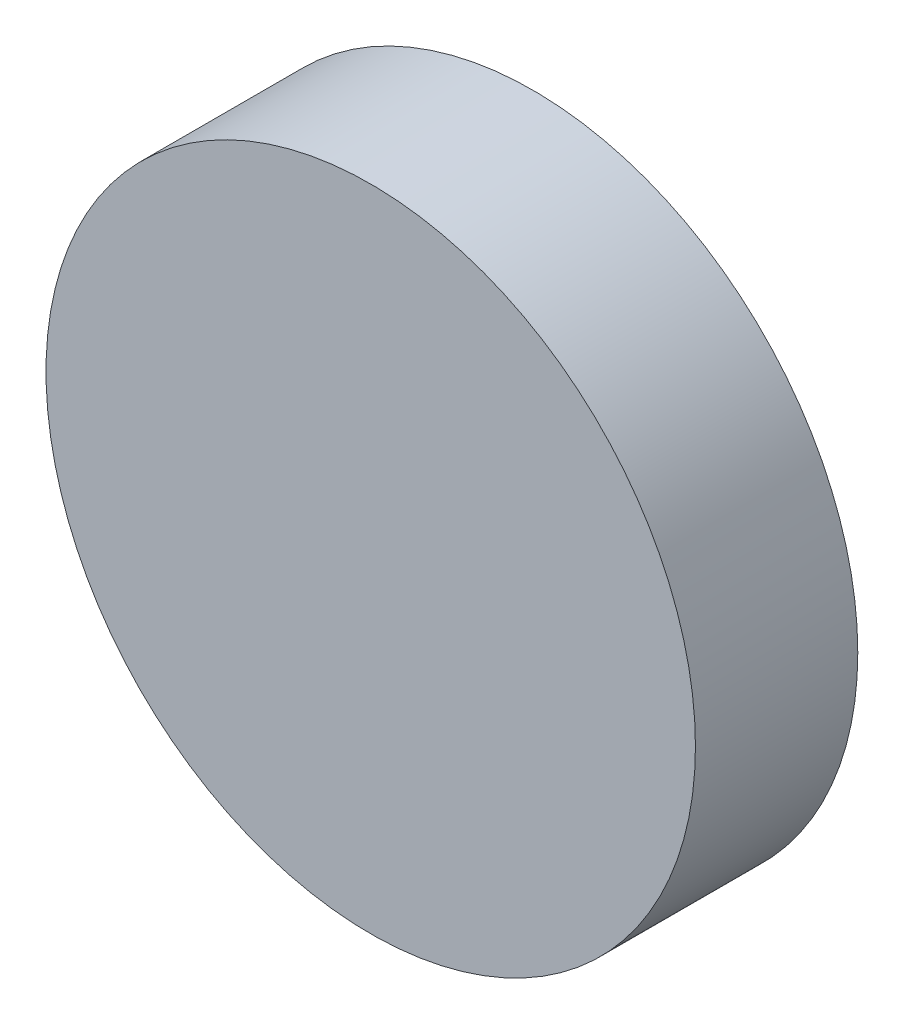
ISO-10303-21;
HEADER;
FILE_DESCRIPTION(('STEP AP214'),'2;1');
FILE_NAME('part.step','',(''),(''),'','','');
FILE_SCHEMA(('AUTOMOTIVE_DESIGN { 1 0 10303 214 1 1 1 1 }'));
ENDSEC;
DATA;
#1=APPLICATION_CONTEXT('core data for automotive mechanical design processes');
#2=APPLICATION_PROTOCOL_DEFINITION('international standard','automotive_design',2000,#1);
#3=PRODUCT_CONTEXT('',#1,'mechanical');
#4=PRODUCT('Part','Part','',(#3));
#5=PRODUCT_RELATED_PRODUCT_CATEGORY('part','',(#4));
#6=PRODUCT_DEFINITION_FORMATION('','',#4);
#7=PRODUCT_DEFINITION_CONTEXT('part definition',#1,'design');
#8=PRODUCT_DEFINITION('design','',#6,#7);
#9=PRODUCT_DEFINITION_SHAPE('','',#8);
#10=(LENGTH_UNIT() NAMED_UNIT(*) SI_UNIT(.MILLI.,.METRE.));
#11=(NAMED_UNIT(*) PLANE_ANGLE_UNIT() SI_UNIT($,.RADIAN.));
#12=(NAMED_UNIT(*) SI_UNIT($,.STERADIAN.) SOLID_ANGLE_UNIT());
#13=UNCERTAINTY_MEASURE_WITH_UNIT(LENGTH_MEASURE(1.E-05),#10,'distance_accuracy_value','');
#14=(GEOMETRIC_REPRESENTATION_CONTEXT(3) GLOBAL_UNCERTAINTY_ASSIGNED_CONTEXT((#13)) GLOBAL_UNIT_ASSIGNED_CONTEXT((#10,
#11,#12)) REPRESENTATION_CONTEXT('',''));
#15=CARTESIAN_POINT('',(0.,0.,0.));
#16=DIRECTION('',(0.,0.,1.));
#17=DIRECTION('',(1.,0.,0.));
#18=AXIS2_PLACEMENT_3D('',#15,#16,#17);
#19=CARTESIAN_POINT('',(0.,0.,1.5875));
#20=DIRECTION('',(0.,0.,-1.));
#21=DIRECTION('',(-1.,0.,0.));
#22=AXIS2_PLACEMENT_3D('',#19,#20,#21);
#23=CYLINDRICAL_SURFACE('',#22,3.175);
#24=CARTESIAN_POINT('',(0.,0.,1.5875));
#25=DIRECTION('',(0.,0.,1.));
#26=DIRECTION('',(1.,0.,0.));
#27=AXIS2_PLACEMENT_3D('',#24,#25,#26);
#28=CIRCLE('',#27,3.175);
#29=CARTESIAN_POINT('',(3.175,0.,1.5875));
#30=VERTEX_POINT('',#29);
#31=EDGE_CURVE('E10',#30,#30,#28,.T.);
#32=ORIENTED_EDGE('',*,*,#31,.F.);
#33=EDGE_LOOP('',(#32));
#34=FACE_BOUND('',#33,.T.);
#35=CARTESIAN_POINT('',(0.,0.,0.));
#36=DIRECTION('',(0.,0.,1.));
#37=DIRECTION('',(1.,0.,0.));
#38=AXIS2_PLACEMENT_3D('',#35,#36,#37);
#39=CIRCLE('',#38,3.175);
#40=CARTESIAN_POINT('',(3.175,0.,0.));
#41=VERTEX_POINT('',#40);
#42=EDGE_CURVE('E34',#41,#41,#39,.T.);
#43=ORIENTED_EDGE('',*,*,#42,.T.);
#44=EDGE_LOOP('',(#43));
#45=FACE_BOUND('',#44,.T.);
#46=ADVANCED_FACE('F31',(#34,#45),#23,.T.);
#47=CARTESIAN_POINT('',(0.,0.,1.5875));
#48=DIRECTION('',(0.,0.,1.));
#49=DIRECTION('',(1.,0.,0.));
#50=AXIS2_PLACEMENT_3D('',#47,#48,#49);
#51=PLANE('',#50);
#52=ORIENTED_EDGE('',*,*,#31,.T.);
#53=EDGE_LOOP('',(#52));
#54=FACE_BOUND('',#53,.T.);
#55=ADVANCED_FACE('F46',(#54),#51,.T.);
#56=CARTESIAN_POINT('',(0.,0.,0.));
#57=DIRECTION('',(0.,0.,1.));
#58=DIRECTION('',(1.,0.,0.));
#59=AXIS2_PLACEMENT_3D('',#56,#57,#58);
#60=PLANE('',#59);
#61=ORIENTED_EDGE('',*,*,#42,.F.);
#62=EDGE_LOOP('',(#61));
#63=FACE_BOUND('',#62,.T.);
#64=ADVANCED_FACE('F44',(#63),#60,.F.);
#65=CLOSED_SHELL('',(#46,#55,#64));
#66=MANIFOLD_SOLID_BREP('B2',#65);
#67=ADVANCED_BREP_SHAPE_REPRESENTATION('',(#18,#66),#14);
#68=SHAPE_DEFINITION_REPRESENTATION(#9,#67);
ENDSEC;
END-ISO-10303-21;
